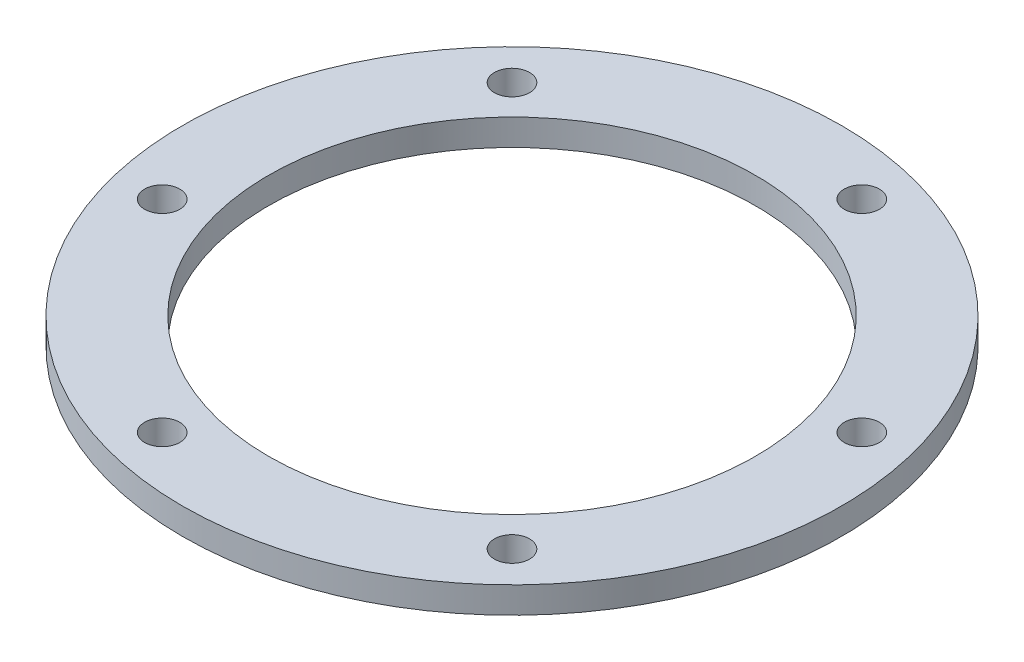
ISO-10303-21;
HEADER;
FILE_DESCRIPTION(('STEP AP214'),'2;1');
FILE_NAME('part.step','',(''),(''),'','','');
FILE_SCHEMA(('AUTOMOTIVE_DESIGN { 1 0 10303 214 1 1 1 1 }'));
ENDSEC;
DATA;
#1=APPLICATION_CONTEXT('core data for automotive mechanical design processes');
#2=APPLICATION_PROTOCOL_DEFINITION('international standard','automotive_design',2000,#1);
#3=PRODUCT_CONTEXT('',#1,'mechanical');
#4=PRODUCT('Part','Part','',(#3));
#5=PRODUCT_RELATED_PRODUCT_CATEGORY('part','',(#4));
#6=PRODUCT_DEFINITION_FORMATION('','',#4);
#7=PRODUCT_DEFINITION_CONTEXT('part definition',#1,'design');
#8=PRODUCT_DEFINITION('design','',#6,#7);
#9=PRODUCT_DEFINITION_SHAPE('','',#8);
#10=(LENGTH_UNIT() NAMED_UNIT(*) SI_UNIT(.MILLI.,.METRE.));
#11=(NAMED_UNIT(*) PLANE_ANGLE_UNIT() SI_UNIT($,.RADIAN.));
#12=(NAMED_UNIT(*) SI_UNIT($,.STERADIAN.) SOLID_ANGLE_UNIT());
#13=UNCERTAINTY_MEASURE_WITH_UNIT(LENGTH_MEASURE(1.E-05),#10,'distance_accuracy_value','');
#14=(GEOMETRIC_REPRESENTATION_CONTEXT(3) GLOBAL_UNCERTAINTY_ASSIGNED_CONTEXT((#13)) GLOBAL_UNIT_ASSIGNED_CONTEXT((#10,
#11,#12)) REPRESENTATION_CONTEXT('',''));
#15=CARTESIAN_POINT('',(0.,0.,0.));
#16=DIRECTION('',(0.,0.,1.));
#17=DIRECTION('',(1.,0.,0.));
#18=AXIS2_PLACEMENT_3D('',#15,#16,#17);
#19=CARTESIAN_POINT('',(0.,3.,0.));
#20=DIRECTION('',(0.,1.,0.));
#21=DIRECTION('',(0.,0.,1.));
#22=AXIS2_PLACEMENT_3D('',#19,#20,#21);
#23=PLANE('',#22);
#24=CARTESIAN_POINT('',(8.41161896583205,3.,-31.3925893543947));
#25=DIRECTION('',(0.,1.,0.));
#26=DIRECTION('',(0.,0.,1.));
#27=AXIS2_PLACEMENT_3D('',#24,#25,#26);
#28=CIRCLE('',#27,1.99999999999983);
#29=CARTESIAN_POINT('',(8.41161896583205,3.,-29.3925893543948));
#30=VERTEX_POINT('',#29);
#31=EDGE_CURVE('E96',#30,#30,#28,.T.);
#32=ORIENTED_EDGE('',*,*,#31,.F.);
#33=EDGE_LOOP('',(#32));
#34=FACE_BOUND('',#33,.T.);
#35=CARTESIAN_POINT('',(-31.3925893543947,3.,8.41161896583196));
#36=DIRECTION('',(0.,1.,0.));
#37=DIRECTION('',(0.,0.,1.));
#38=AXIS2_PLACEMENT_3D('',#35,#36,#37);
#39=CIRCLE('',#38,1.99999999999983);
#40=CARTESIAN_POINT('',(-31.3925893543947,3.,10.4116189658318));
#41=VERTEX_POINT('',#40);
#42=EDGE_CURVE('E80',#41,#41,#39,.T.);
#43=ORIENTED_EDGE('',*,*,#42,.F.);
#44=EDGE_LOOP('',(#43));
#45=FACE_BOUND('',#44,.T.);
#46=CARTESIAN_POINT('',(22.9809703885629,3.,22.9809703885627));
#47=DIRECTION('',(0.,1.,0.));
#48=DIRECTION('',(0.,0.,1.));
#49=AXIS2_PLACEMENT_3D('',#46,#47,#48);
#50=CIRCLE('',#49,1.99999999999983);
#51=CARTESIAN_POINT('',(22.9809703885629,3.,24.9809703885625));
#52=VERTEX_POINT('',#51);
#53=EDGE_CURVE('E64',#52,#52,#50,.T.);
#54=ORIENTED_EDGE('',*,*,#53,.F.);
#55=EDGE_LOOP('',(#54));
#56=FACE_BOUND('',#55,.T.);
#57=CARTESIAN_POINT('',(0.,3.,0.));
#58=DIRECTION('',(0.,1.,0.));
#59=DIRECTION('',(0.,0.,1.));
#60=AXIS2_PLACEMENT_3D('',#57,#58,#59);
#61=CIRCLE('',#60,37.5);
#62=CARTESIAN_POINT('',(0.,3.,37.5));
#63=VERTEX_POINT('',#62);
#64=EDGE_CURVE('E10',#63,#63,#61,.T.);
#65=ORIENTED_EDGE('',*,*,#64,.T.);
#66=EDGE_LOOP('',(#65));
#67=FACE_BOUND('',#66,.T.);
#68=CARTESIAN_POINT('',(0.,3.,0.));
#69=DIRECTION('',(0.,1.,0.));
#70=DIRECTION('',(0.,0.,1.));
#71=AXIS2_PLACEMENT_3D('',#68,#69,#70);
#72=CIRCLE('',#71,27.7);
#73=CARTESIAN_POINT('',(0.,3.,27.7));
#74=VERTEX_POINT('',#73);
#75=EDGE_CURVE('E58',#74,#74,#72,.T.);
#76=ORIENTED_EDGE('',*,*,#75,.F.);
#77=EDGE_LOOP('',(#76));
#78=FACE_BOUND('',#77,.T.);
#79=CARTESIAN_POINT('',(-8.41161896583182,3.,31.3925893543947));
#80=DIRECTION('',(0.,1.,0.));
#81=DIRECTION('',(0.,0.,1.));
#82=AXIS2_PLACEMENT_3D('',#79,#80,#81);
#83=CIRCLE('',#82,1.99999999999983);
#84=CARTESIAN_POINT('',(-8.41161896583182,3.,33.3925893543946));
#85=VERTEX_POINT('',#84);
#86=EDGE_CURVE('E72',#85,#85,#83,.T.);
#87=ORIENTED_EDGE('',*,*,#86,.F.);
#88=EDGE_LOOP('',(#87));
#89=FACE_BOUND('',#88,.T.);
#90=CARTESIAN_POINT('',(-22.9809703885628,3.,-22.9809703885628));
#91=DIRECTION('',(0.,1.,0.));
#92=DIRECTION('',(0.,0.,1.));
#93=AXIS2_PLACEMENT_3D('',#90,#91,#92);
#94=CIRCLE('',#93,1.99999999999983);
#95=CARTESIAN_POINT('',(-22.9809703885628,3.,-20.980970388563));
#96=VERTEX_POINT('',#95);
#97=EDGE_CURVE('E88',#96,#96,#94,.T.);
#98=ORIENTED_EDGE('',*,*,#97,.F.);
#99=EDGE_LOOP('',(#98));
#100=FACE_BOUND('',#99,.T.);
#101=CARTESIAN_POINT('',(31.3925893543948,3.,-8.41161896583174));
#102=DIRECTION('',(0.,1.,0.));
#103=DIRECTION('',(0.,0.,1.));
#104=AXIS2_PLACEMENT_3D('',#101,#102,#103);
#105=CIRCLE('',#104,1.99999999999983);
#106=CARTESIAN_POINT('',(31.3925893543948,3.,-6.4116189658319));
#107=VERTEX_POINT('',#106);
#108=EDGE_CURVE('E104',#107,#107,#105,.T.);
#109=ORIENTED_EDGE('',*,*,#108,.F.);
#110=EDGE_LOOP('',(#109));
#111=FACE_BOUND('',#110,.T.);
#112=ADVANCED_FACE('F43',(#34,#45,#56,#67,#78,#89,#100,#111),#23,.T.);
#113=CARTESIAN_POINT('',(0.,0.,0.));
#114=DIRECTION('',(0.,1.,0.));
#115=DIRECTION('',(0.,0.,1.));
#116=AXIS2_PLACEMENT_3D('',#113,#114,#115);
#117=PLANE('',#116);
#118=CARTESIAN_POINT('',(0.,0.,0.));
#119=DIRECTION('',(0.,1.,0.));
#120=DIRECTION('',(0.,0.,1.));
#121=AXIS2_PLACEMENT_3D('',#118,#119,#120);
#122=CIRCLE('',#121,37.5);
#123=CARTESIAN_POINT('',(0.,0.,37.5));
#124=VERTEX_POINT('',#123);
#125=EDGE_CURVE('E47',#124,#124,#122,.T.);
#126=ORIENTED_EDGE('',*,*,#125,.F.);
#127=EDGE_LOOP('',(#126));
#128=FACE_BOUND('',#127,.T.);
#129=CARTESIAN_POINT('',(0.,0.,0.));
#130=DIRECTION('',(0.,1.,0.));
#131=DIRECTION('',(0.,0.,1.));
#132=AXIS2_PLACEMENT_3D('',#129,#130,#131);
#133=CIRCLE('',#132,27.7);
#134=CARTESIAN_POINT('',(0.,0.,27.7));
#135=VERTEX_POINT('',#134);
#136=EDGE_CURVE('E60',#135,#135,#133,.T.);
#137=ORIENTED_EDGE('',*,*,#136,.T.);
#138=EDGE_LOOP('',(#137));
#139=FACE_BOUND('',#138,.T.);
#140=CARTESIAN_POINT('',(22.9809703885629,0.,22.9809703885627));
#141=DIRECTION('',(0.,1.,0.));
#142=DIRECTION('',(0.,0.,1.));
#143=AXIS2_PLACEMENT_3D('',#140,#141,#142);
#144=CIRCLE('',#143,1.99999999999983);
#145=CARTESIAN_POINT('',(22.9809703885629,0.,24.9809703885625));
#146=VERTEX_POINT('',#145);
#147=EDGE_CURVE('E68',#146,#146,#144,.T.);
#148=ORIENTED_EDGE('',*,*,#147,.T.);
#149=EDGE_LOOP('',(#148));
#150=FACE_BOUND('',#149,.T.);
#151=CARTESIAN_POINT('',(-8.41161896583182,0.,31.3925893543947));
#152=DIRECTION('',(0.,1.,0.));
#153=DIRECTION('',(0.,0.,1.));
#154=AXIS2_PLACEMENT_3D('',#151,#152,#153);
#155=CIRCLE('',#154,1.99999999999983);
#156=CARTESIAN_POINT('',(-8.41161896583182,0.,33.3925893543946));
#157=VERTEX_POINT('',#156);
#158=EDGE_CURVE('E76',#157,#157,#155,.T.);
#159=ORIENTED_EDGE('',*,*,#158,.T.);
#160=EDGE_LOOP('',(#159));
#161=FACE_BOUND('',#160,.T.);
#162=CARTESIAN_POINT('',(-31.3925893543947,0.,8.41161896583196));
#163=DIRECTION('',(0.,1.,0.));
#164=DIRECTION('',(0.,0.,1.));
#165=AXIS2_PLACEMENT_3D('',#162,#163,#164);
#166=CIRCLE('',#165,1.99999999999983);
#167=CARTESIAN_POINT('',(-31.3925893543947,0.,10.4116189658318));
#168=VERTEX_POINT('',#167);
#169=EDGE_CURVE('E84',#168,#168,#166,.T.);
#170=ORIENTED_EDGE('',*,*,#169,.T.);
#171=EDGE_LOOP('',(#170));
#172=FACE_BOUND('',#171,.T.);
#173=CARTESIAN_POINT('',(-22.9809703885628,0.,-22.9809703885628));
#174=DIRECTION('',(0.,1.,0.));
#175=DIRECTION('',(0.,0.,1.));
#176=AXIS2_PLACEMENT_3D('',#173,#174,#175);
#177=CIRCLE('',#176,1.99999999999983);
#178=CARTESIAN_POINT('',(-22.9809703885628,0.,-20.980970388563));
#179=VERTEX_POINT('',#178);
#180=EDGE_CURVE('E92',#179,#179,#177,.T.);
#181=ORIENTED_EDGE('',*,*,#180,.T.);
#182=EDGE_LOOP('',(#181));
#183=FACE_BOUND('',#182,.T.);
#184=CARTESIAN_POINT('',(8.41161896583205,0.,-31.3925893543947));
#185=DIRECTION('',(0.,1.,0.));
#186=DIRECTION('',(0.,0.,1.));
#187=AXIS2_PLACEMENT_3D('',#184,#185,#186);
#188=CIRCLE('',#187,1.99999999999983);
#189=CARTESIAN_POINT('',(8.41161896583205,0.,-29.3925893543948));
#190=VERTEX_POINT('',#189);
#191=EDGE_CURVE('E100',#190,#190,#188,.T.);
#192=ORIENTED_EDGE('',*,*,#191,.T.);
#193=EDGE_LOOP('',(#192));
#194=FACE_BOUND('',#193,.T.);
#195=CARTESIAN_POINT('',(31.3925893543948,0.,-8.41161896583174));
#196=DIRECTION('',(0.,1.,0.));
#197=DIRECTION('',(0.,0.,1.));
#198=AXIS2_PLACEMENT_3D('',#195,#196,#197);
#199=CIRCLE('',#198,1.99999999999983);
#200=CARTESIAN_POINT('',(31.3925893543948,0.,-6.4116189658319));
#201=VERTEX_POINT('',#200);
#202=EDGE_CURVE('E108',#201,#201,#199,.T.);
#203=ORIENTED_EDGE('',*,*,#202,.T.);
#204=EDGE_LOOP('',(#203));
#205=FACE_BOUND('',#204,.T.);
#206=ADVANCED_FACE('F122',(#128,#139,#150,#161,#172,#183,#194,#205),#117,.F.);
#207=CARTESIAN_POINT('',(0.,3.,0.));
#208=DIRECTION('',(0.,-1.,0.));
#209=DIRECTION('',(0.,0.,-1.));
#210=AXIS2_PLACEMENT_3D('',#207,#208,#209);
#211=CYLINDRICAL_SURFACE('',#210,37.5);
#212=ORIENTED_EDGE('',*,*,#64,.F.);
#213=EDGE_LOOP('',(#212));
#214=FACE_BOUND('',#213,.T.);
#215=ORIENTED_EDGE('',*,*,#125,.T.);
#216=EDGE_LOOP('',(#215));
#217=FACE_BOUND('',#216,.T.);
#218=ADVANCED_FACE('F45',(#214,#217),#211,.T.);
#219=CARTESIAN_POINT('',(0.,3.,0.));
#220=DIRECTION('',(0.,-1.,0.));
#221=DIRECTION('',(0.,0.,-1.));
#222=AXIS2_PLACEMENT_3D('',#219,#220,#221);
#223=CYLINDRICAL_SURFACE('',#222,27.7);
#224=ORIENTED_EDGE('',*,*,#75,.T.);
#225=EDGE_LOOP('',(#224));
#226=FACE_BOUND('',#225,.T.);
#227=ORIENTED_EDGE('',*,*,#136,.F.);
#228=EDGE_LOOP('',(#227));
#229=FACE_BOUND('',#228,.T.);
#230=ADVANCED_FACE('F132',(#226,#229),#223,.F.);
#231=CARTESIAN_POINT('',(22.9809703885629,3.,22.9809703885627));
#232=DIRECTION('',(0.,-1.,0.));
#233=DIRECTION('',(0.,0.,-1.));
#234=AXIS2_PLACEMENT_3D('',#231,#232,#233);
#235=CYLINDRICAL_SURFACE('',#234,1.99999999999983);
#236=ORIENTED_EDGE('',*,*,#53,.T.);
#237=EDGE_LOOP('',(#236));
#238=FACE_BOUND('',#237,.T.);
#239=ORIENTED_EDGE('',*,*,#147,.F.);
#240=EDGE_LOOP('',(#239));
#241=FACE_BOUND('',#240,.T.);
#242=ADVANCED_FACE('F135',(#238,#241),#235,.F.);
#243=CARTESIAN_POINT('',(-8.41161896583182,3.,31.3925893543947));
#244=DIRECTION('',(0.,-1.,0.));
#245=DIRECTION('',(0.,0.,-1.));
#246=AXIS2_PLACEMENT_3D('',#243,#244,#245);
#247=CYLINDRICAL_SURFACE('',#246,1.99999999999983);
#248=ORIENTED_EDGE('',*,*,#86,.T.);
#249=EDGE_LOOP('',(#248));
#250=FACE_BOUND('',#249,.T.);
#251=ORIENTED_EDGE('',*,*,#158,.F.);
#252=EDGE_LOOP('',(#251));
#253=FACE_BOUND('',#252,.T.);
#254=ADVANCED_FACE('F139',(#250,#253),#247,.F.);
#255=CARTESIAN_POINT('',(-31.3925893543947,3.,8.41161896583196));
#256=DIRECTION('',(0.,-1.,0.));
#257=DIRECTION('',(0.,0.,-1.));
#258=AXIS2_PLACEMENT_3D('',#255,#256,#257);
#259=CYLINDRICAL_SURFACE('',#258,1.99999999999983);
#260=ORIENTED_EDGE('',*,*,#42,.T.);
#261=EDGE_LOOP('',(#260));
#262=FACE_BOUND('',#261,.T.);
#263=ORIENTED_EDGE('',*,*,#169,.F.);
#264=EDGE_LOOP('',(#263));
#265=FACE_BOUND('',#264,.T.);
#266=ADVANCED_FACE('F143',(#262,#265),#259,.F.);
#267=CARTESIAN_POINT('',(-22.9809703885628,3.,-22.9809703885628));
#268=DIRECTION('',(0.,-1.,0.));
#269=DIRECTION('',(0.,0.,-1.));
#270=AXIS2_PLACEMENT_3D('',#267,#268,#269);
#271=CYLINDRICAL_SURFACE('',#270,1.99999999999983);
#272=ORIENTED_EDGE('',*,*,#97,.T.);
#273=EDGE_LOOP('',(#272));
#274=FACE_BOUND('',#273,.T.);
#275=ORIENTED_EDGE('',*,*,#180,.F.);
#276=EDGE_LOOP('',(#275));
#277=FACE_BOUND('',#276,.T.);
#278=ADVANCED_FACE('F147',(#274,#277),#271,.F.);
#279=CARTESIAN_POINT('',(8.41161896583205,3.,-31.3925893543947));
#280=DIRECTION('',(0.,-1.,0.));
#281=DIRECTION('',(0.,0.,-1.));
#282=AXIS2_PLACEMENT_3D('',#279,#280,#281);
#283=CYLINDRICAL_SURFACE('',#282,1.99999999999983);
#284=ORIENTED_EDGE('',*,*,#31,.T.);
#285=EDGE_LOOP('',(#284));
#286=FACE_BOUND('',#285,.T.);
#287=ORIENTED_EDGE('',*,*,#191,.F.);
#288=EDGE_LOOP('',(#287));
#289=FACE_BOUND('',#288,.T.);
#290=ADVANCED_FACE('F151',(#286,#289),#283,.F.);
#291=CARTESIAN_POINT('',(31.3925893543948,3.,-8.41161896583174));
#292=DIRECTION('',(0.,-1.,0.));
#293=DIRECTION('',(0.,0.,-1.));
#294=AXIS2_PLACEMENT_3D('',#291,#292,#293);
#295=CYLINDRICAL_SURFACE('',#294,1.99999999999983);
#296=ORIENTED_EDGE('',*,*,#108,.T.);
#297=EDGE_LOOP('',(#296));
#298=FACE_BOUND('',#297,.T.);
#299=ORIENTED_EDGE('',*,*,#202,.F.);
#300=EDGE_LOOP('',(#299));
#301=FACE_BOUND('',#300,.T.);
#302=ADVANCED_FACE('F118',(#298,#301),#295,.F.);
#303=CLOSED_SHELL('',(#112,#206,#218,#230,#242,#254,#266,#278,#290,#302));
#304=MANIFOLD_SOLID_BREP('B2',#303);
#305=ADVANCED_BREP_SHAPE_REPRESENTATION('',(#18,#304),#14);
#306=SHAPE_DEFINITION_REPRESENTATION(#9,#305);
ENDSEC;
END-ISO-10303-21;
